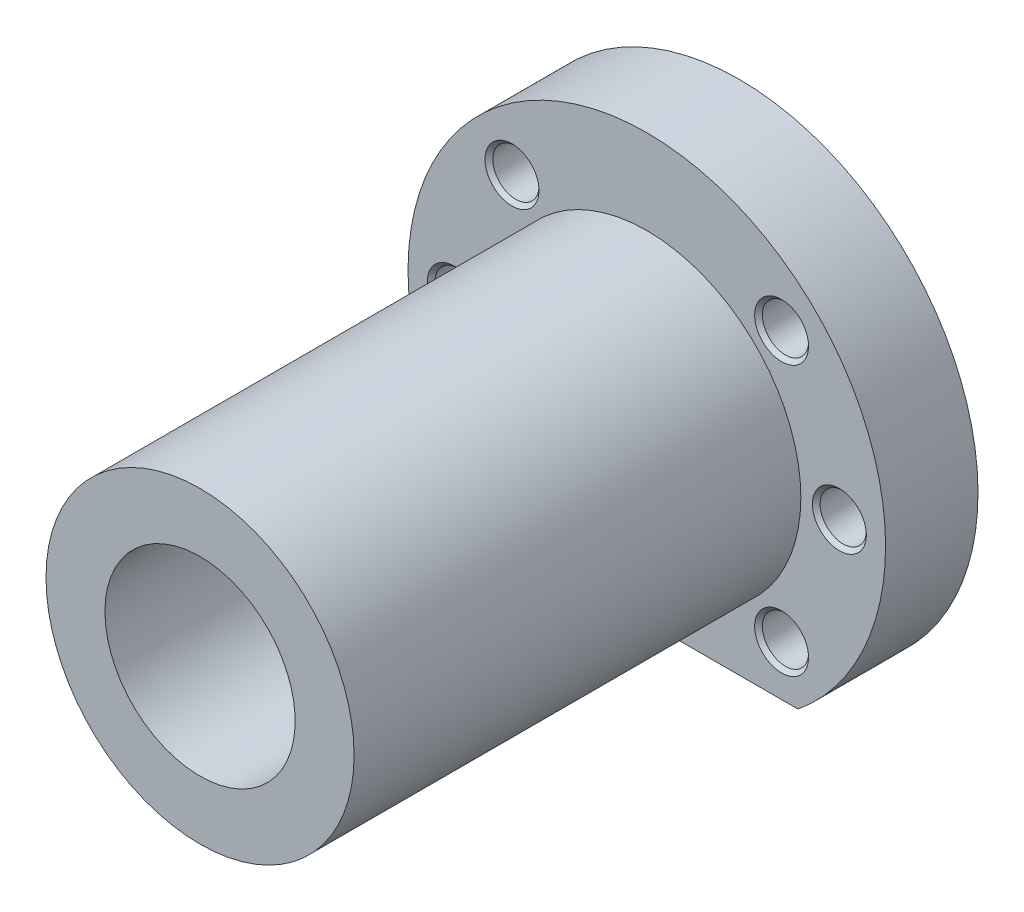
ISO-10303-21;
HEADER;
FILE_DESCRIPTION(('STEP AP214'),'2;1');
FILE_NAME('part.step','',(''),(''),'','','');
FILE_SCHEMA(('AUTOMOTIVE_DESIGN { 1 0 10303 214 1 1 1 1 }'));
ENDSEC;
DATA;
#1=APPLICATION_CONTEXT('core data for automotive mechanical design processes');
#2=APPLICATION_PROTOCOL_DEFINITION('international standard','automotive_design',2000,#1);
#3=PRODUCT_CONTEXT('',#1,'mechanical');
#4=PRODUCT('Part','Part','',(#3));
#5=PRODUCT_RELATED_PRODUCT_CATEGORY('part','',(#4));
#6=PRODUCT_DEFINITION_FORMATION('','',#4);
#7=PRODUCT_DEFINITION_CONTEXT('part definition',#1,'design');
#8=PRODUCT_DEFINITION('design','',#6,#7);
#9=PRODUCT_DEFINITION_SHAPE('','',#8);
#10=(LENGTH_UNIT() NAMED_UNIT(*) SI_UNIT(.MILLI.,.METRE.));
#11=(NAMED_UNIT(*) PLANE_ANGLE_UNIT() SI_UNIT($,.RADIAN.));
#12=(NAMED_UNIT(*) SI_UNIT($,.STERADIAN.) SOLID_ANGLE_UNIT());
#13=UNCERTAINTY_MEASURE_WITH_UNIT(LENGTH_MEASURE(1.E-05),#10,'distance_accuracy_value','');
#14=(GEOMETRIC_REPRESENTATION_CONTEXT(3) GLOBAL_UNCERTAINTY_ASSIGNED_CONTEXT((#13)) GLOBAL_UNIT_ASSIGNED_CONTEXT((#10,
#11,#12)) REPRESENTATION_CONTEXT('',''));
#15=CARTESIAN_POINT('',(0.,0.,0.));
#16=DIRECTION('',(0.,0.,1.));
#17=DIRECTION('',(1.,0.,0.));
#18=AXIS2_PLACEMENT_3D('',#15,#16,#17);
#19=CARTESIAN_POINT('',(0.,0.,58.));
#20=DIRECTION('',(0.,0.,-1.));
#21=DIRECTION('',(-1.,0.,0.));
#22=AXIS2_PLACEMENT_3D('',#19,#20,#21);
#23=CYLINDRICAL_SURFACE('',#22,20.);
#24=CARTESIAN_POINT('',(0.,0.,58.));
#25=DIRECTION('',(0.,0.,1.));
#26=DIRECTION('',(1.,0.,0.));
#27=AXIS2_PLACEMENT_3D('',#24,#25,#26);
#28=CIRCLE('',#27,20.);
#29=CARTESIAN_POINT('',(20.,0.,58.));
#30=VERTEX_POINT('',#29);
#31=EDGE_CURVE('E77',#30,#30,#28,.T.);
#32=ORIENTED_EDGE('',*,*,#31,.F.);
#33=EDGE_LOOP('',(#32));
#34=FACE_BOUND('',#33,.T.);
#35=CARTESIAN_POINT('',(0.,0.,0.));
#36=DIRECTION('',(0.,0.,1.));
#37=DIRECTION('',(1.,0.,0.));
#38=AXIS2_PLACEMENT_3D('',#35,#36,#37);
#39=CIRCLE('',#38,20.);
#40=CARTESIAN_POINT('',(20.,0.,0.));
#41=VERTEX_POINT('',#40);
#42=EDGE_CURVE('E73',#41,#41,#39,.T.);
#43=ORIENTED_EDGE('',*,*,#42,.T.);
#44=EDGE_LOOP('',(#43));
#45=FACE_BOUND('',#44,.T.);
#46=ADVANCED_FACE('F33',(#34,#45),#23,.T.);
#47=CARTESIAN_POINT('',(0.,0.,58.));
#48=DIRECTION('',(0.,0.,1.));
#49=DIRECTION('',(1.,0.,0.));
#50=AXIS2_PLACEMENT_3D('',#47,#48,#49);
#51=PLANE('',#50);
#52=CARTESIAN_POINT('',(0.,0.,58.));
#53=DIRECTION('',(0.,0.,-1.));
#54=DIRECTION('',(-1.,0.,0.));
#55=AXIS2_PLACEMENT_3D('',#52,#53,#54);
#56=CIRCLE('',#55,12.35);
#57=CARTESIAN_POINT('',(-12.35,0.,58.));
#58=VERTEX_POINT('',#57);
#59=EDGE_CURVE('E70',#58,#58,#56,.T.);
#60=ORIENTED_EDGE('',*,*,#59,.T.);
#61=EDGE_LOOP('',(#60));
#62=FACE_BOUND('',#61,.T.);
#63=ORIENTED_EDGE('',*,*,#31,.T.);
#64=EDGE_LOOP('',(#63));
#65=FACE_BOUND('',#64,.T.);
#66=ADVANCED_FACE('F179',(#62,#65),#51,.T.);
#67=CARTESIAN_POINT('',(0.,0.,-12.));
#68=DIRECTION('',(0.,0.,1.));
#69=DIRECTION('',(1.,0.,0.));
#70=AXIS2_PLACEMENT_3D('',#67,#68,#69);
#71=CYLINDRICAL_SURFACE('',#70,31.);
#72=CARTESIAN_POINT('',(0.,0.,0.));
#73=DIRECTION('',(0.,0.,-1.));
#74=DIRECTION('',(-1.,0.,0.));
#75=AXIS2_PLACEMENT_3D('',#72,#73,#74);
#76=CIRCLE('',#75,31.);
#77=CARTESIAN_POINT('',(-19.6214168703486,-24.,0.));
#78=VERTEX_POINT('',#77);
#79=CARTESIAN_POINT('',(19.6214168703486,-24.,0.));
#80=VERTEX_POINT('',#79);
#81=EDGE_CURVE('E74',#78,#80,#76,.T.);
#82=ORIENTED_EDGE('',*,*,#81,.T.);
#83=DIRECTION('',(0.,0.,-1.));
#84=VECTOR('',#83,1.);
#85=CARTESIAN_POINT('',(19.6214168703486,-24.,0.));
#86=LINE('',#85,#84);
#87=CARTESIAN_POINT('',(19.6214168703486,-24.,-12.));
#88=VERTEX_POINT('',#87);
#89=EDGE_CURVE('E48',#80,#88,#86,.T.);
#90=ORIENTED_EDGE('',*,*,#89,.T.);
#91=CARTESIAN_POINT('',(0.,0.,-12.));
#92=DIRECTION('',(0.,0.,-1.));
#93=DIRECTION('',(-1.,0.,0.));
#94=AXIS2_PLACEMENT_3D('',#91,#92,#93);
#95=CIRCLE('',#94,31.);
#96=CARTESIAN_POINT('',(-19.6214168703486,-24.,-12.));
#97=VERTEX_POINT('',#96);
#98=EDGE_CURVE('E69',#97,#88,#95,.T.);
#99=ORIENTED_EDGE('',*,*,#98,.F.);
#100=DIRECTION('',(0.,0.,-1.));
#101=VECTOR('',#100,1.);
#102=CARTESIAN_POINT('',(-19.6214168703486,-24.,0.));
#103=LINE('',#102,#101);
#104=EDGE_CURVE('E57',#78,#97,#103,.T.);
#105=ORIENTED_EDGE('',*,*,#104,.F.);
#106=EDGE_LOOP('',(#82,#90,#99,#105));
#107=FACE_BOUND('',#106,.T.);
#108=ADVANCED_FACE('F72',(#107),#71,.T.);
#109=CARTESIAN_POINT('',(0.,0.,-12.));
#110=DIRECTION('',(0.,0.,-1.));
#111=DIRECTION('',(-1.,0.,0.));
#112=AXIS2_PLACEMENT_3D('',#109,#110,#111);
#113=PLANE('',#112);
#114=CARTESIAN_POINT('',(17.5,17.5,-12.));
#115=DIRECTION('',(0.,0.,-1.));
#116=DIRECTION('',(-1.,0.,0.));
#117=AXIS2_PLACEMENT_3D('',#114,#115,#116);
#118=CIRCLE('',#117,3.5);
#119=CARTESIAN_POINT('',(14.,17.5,-12.));
#120=VERTEX_POINT('',#119);
#121=EDGE_CURVE('E11',#120,#120,#118,.F.);
#122=ORIENTED_EDGE('',*,*,#121,.T.);
#123=EDGE_LOOP('',(#122));
#124=FACE_BOUND('',#123,.T.);
#125=CARTESIAN_POINT('',(25.,0.,-12.));
#126=DIRECTION('',(0.,0.,-1.));
#127=DIRECTION('',(-1.,0.,0.));
#128=AXIS2_PLACEMENT_3D('',#125,#126,#127);
#129=CIRCLE('',#128,3.5);
#130=CARTESIAN_POINT('',(21.5,0.,-12.));
#131=VERTEX_POINT('',#130);
#132=EDGE_CURVE('E41',#131,#131,#129,.F.);
#133=ORIENTED_EDGE('',*,*,#132,.T.);
#134=EDGE_LOOP('',(#133));
#135=FACE_BOUND('',#134,.T.);
#136=CARTESIAN_POINT('',(17.5,-17.5,-12.));
#137=DIRECTION('',(0.,0.,-1.));
#138=DIRECTION('',(-1.,0.,0.));
#139=AXIS2_PLACEMENT_3D('',#136,#137,#138);
#140=CIRCLE('',#139,3.5);
#141=CARTESIAN_POINT('',(14.,-17.5,-12.));
#142=VERTEX_POINT('',#141);
#143=EDGE_CURVE('E147',#142,#142,#140,.F.);
#144=ORIENTED_EDGE('',*,*,#143,.T.);
#145=EDGE_LOOP('',(#144));
#146=FACE_BOUND('',#145,.T.);
#147=CARTESIAN_POINT('',(-17.5,-17.5,-12.));
#148=DIRECTION('',(0.,0.,-1.));
#149=DIRECTION('',(-1.,0.,0.));
#150=AXIS2_PLACEMENT_3D('',#147,#148,#149);
#151=CIRCLE('',#150,3.5);
#152=CARTESIAN_POINT('',(-21.,-17.5,-12.));
#153=VERTEX_POINT('',#152);
#154=EDGE_CURVE('E144',#153,#153,#151,.F.);
#155=ORIENTED_EDGE('',*,*,#154,.T.);
#156=EDGE_LOOP('',(#155));
#157=FACE_BOUND('',#156,.T.);
#158=CARTESIAN_POINT('',(-25.,0.,-12.));
#159=DIRECTION('',(0.,0.,-1.));
#160=DIRECTION('',(-1.,0.,0.));
#161=AXIS2_PLACEMENT_3D('',#158,#159,#160);
#162=CIRCLE('',#161,3.5);
#163=CARTESIAN_POINT('',(-28.5,0.,-12.));
#164=VERTEX_POINT('',#163);
#165=EDGE_CURVE('E141',#164,#164,#162,.F.);
#166=ORIENTED_EDGE('',*,*,#165,.T.);
#167=EDGE_LOOP('',(#166));
#168=FACE_BOUND('',#167,.T.);
#169=CARTESIAN_POINT('',(-17.5,17.5,-12.));
#170=DIRECTION('',(0.,0.,-1.));
#171=DIRECTION('',(-1.,0.,0.));
#172=AXIS2_PLACEMENT_3D('',#169,#170,#171);
#173=CIRCLE('',#172,3.5);
#174=CARTESIAN_POINT('',(-21.,17.5,-12.));
#175=VERTEX_POINT('',#174);
#176=EDGE_CURVE('E138',#175,#175,#173,.F.);
#177=ORIENTED_EDGE('',*,*,#176,.T.);
#178=EDGE_LOOP('',(#177));
#179=FACE_BOUND('',#178,.T.);
#180=CARTESIAN_POINT('',(0.,0.,-12.));
#181=DIRECTION('',(0.,0.,-1.));
#182=DIRECTION('',(-1.,0.,0.));
#183=AXIS2_PLACEMENT_3D('',#180,#181,#182);
#184=CIRCLE('',#183,12.35);
#185=CARTESIAN_POINT('',(-12.35,0.,-12.));
#186=VERTEX_POINT('',#185);
#187=EDGE_CURVE('E419',#186,#186,#184,.T.);
#188=ORIENTED_EDGE('',*,*,#187,.F.);
#189=EDGE_LOOP('',(#188));
#190=FACE_BOUND('',#189,.T.);
#191=DIRECTION('',(1.,0.,0.));
#192=VECTOR('',#191,1.);
#193=CARTESIAN_POINT('',(19.6214168703486,-24.,-12.));
#194=LINE('',#193,#192);
#195=EDGE_CURVE('E60',#97,#88,#194,.T.);
#196=ORIENTED_EDGE('',*,*,#195,.F.);
#197=ORIENTED_EDGE('',*,*,#98,.T.);
#198=EDGE_LOOP('',(#196,#197));
#199=FACE_BOUND('',#198,.T.);
#200=ADVANCED_FACE('F68',(#124,#135,#146,#157,#168,#179,#190,#199),#113,.T.);
#201=CARTESIAN_POINT('',(0.,0.,0.));
#202=DIRECTION('',(0.,0.,-1.));
#203=DIRECTION('',(-1.,0.,0.));
#204=AXIS2_PLACEMENT_3D('',#201,#202,#203);
#205=PLANE('',#204);
#206=CARTESIAN_POINT('',(-25.,0.,0.));
#207=DIRECTION('',(0.,0.,-1.));
#208=DIRECTION('',(-1.,0.,0.));
#209=AXIS2_PLACEMENT_3D('',#206,#207,#208);
#210=CIRCLE('',#209,3.49999999999999);
#211=CARTESIAN_POINT('',(-28.5,0.,0.));
#212=VERTEX_POINT('',#211);
#213=EDGE_CURVE('E99',#212,#212,#210,.T.);
#214=ORIENTED_EDGE('',*,*,#213,.T.);
#215=EDGE_LOOP('',(#214));
#216=FACE_BOUND('',#215,.T.);
#217=CARTESIAN_POINT('',(-17.5,-17.5,0.));
#218=DIRECTION('',(0.,0.,-1.));
#219=DIRECTION('',(-1.,0.,0.));
#220=AXIS2_PLACEMENT_3D('',#217,#218,#219);
#221=CIRCLE('',#220,3.49999999999999);
#222=CARTESIAN_POINT('',(-21.,-17.5,0.));
#223=VERTEX_POINT('',#222);
#224=EDGE_CURVE('E96',#223,#223,#221,.T.);
#225=ORIENTED_EDGE('',*,*,#224,.T.);
#226=EDGE_LOOP('',(#225));
#227=FACE_BOUND('',#226,.T.);
#228=CARTESIAN_POINT('',(17.5,-17.5,0.));
#229=DIRECTION('',(0.,0.,-1.));
#230=DIRECTION('',(-1.,0.,0.));
#231=AXIS2_PLACEMENT_3D('',#228,#229,#230);
#232=CIRCLE('',#231,3.49999999999999);
#233=CARTESIAN_POINT('',(14.,-17.5,0.));
#234=VERTEX_POINT('',#233);
#235=EDGE_CURVE('E93',#234,#234,#232,.T.);
#236=ORIENTED_EDGE('',*,*,#235,.T.);
#237=EDGE_LOOP('',(#236));
#238=FACE_BOUND('',#237,.T.);
#239=CARTESIAN_POINT('',(25.,0.,0.));
#240=DIRECTION('',(0.,0.,-1.));
#241=DIRECTION('',(-1.,0.,0.));
#242=AXIS2_PLACEMENT_3D('',#239,#240,#241);
#243=CIRCLE('',#242,3.49999999999999);
#244=CARTESIAN_POINT('',(21.5,0.,0.));
#245=VERTEX_POINT('',#244);
#246=EDGE_CURVE('E90',#245,#245,#243,.T.);
#247=ORIENTED_EDGE('',*,*,#246,.T.);
#248=EDGE_LOOP('',(#247));
#249=FACE_BOUND('',#248,.T.);
#250=CARTESIAN_POINT('',(17.5,17.5,0.));
#251=DIRECTION('',(0.,0.,-1.));
#252=DIRECTION('',(-1.,0.,0.));
#253=AXIS2_PLACEMENT_3D('',#250,#251,#252);
#254=CIRCLE('',#253,3.49999999999999);
#255=CARTESIAN_POINT('',(14.,17.5,0.));
#256=VERTEX_POINT('',#255);
#257=EDGE_CURVE('E87',#256,#256,#254,.T.);
#258=ORIENTED_EDGE('',*,*,#257,.T.);
#259=EDGE_LOOP('',(#258));
#260=FACE_BOUND('',#259,.T.);
#261=CARTESIAN_POINT('',(-17.5,17.5,0.));
#262=DIRECTION('',(0.,0.,-1.));
#263=DIRECTION('',(-1.,0.,0.));
#264=AXIS2_PLACEMENT_3D('',#261,#262,#263);
#265=CIRCLE('',#264,3.49999999999999);
#266=CARTESIAN_POINT('',(-21.,17.5,0.));
#267=VERTEX_POINT('',#266);
#268=EDGE_CURVE('E83',#267,#267,#265,.T.);
#269=ORIENTED_EDGE('',*,*,#268,.T.);
#270=EDGE_LOOP('',(#269));
#271=FACE_BOUND('',#270,.T.);
#272=ORIENTED_EDGE('',*,*,#42,.F.);
#273=EDGE_LOOP('',(#272));
#274=FACE_BOUND('',#273,.T.);
#275=ORIENTED_EDGE('',*,*,#81,.F.);
#276=DIRECTION('',(1.,0.,0.));
#277=VECTOR('',#276,1.);
#278=CARTESIAN_POINT('',(19.6214168703486,-24.,0.));
#279=LINE('',#278,#277);
#280=EDGE_CURVE('E53',#78,#80,#279,.T.);
#281=ORIENTED_EDGE('',*,*,#280,.T.);
#282=EDGE_LOOP('',(#275,#281));
#283=FACE_BOUND('',#282,.T.);
#284=ADVANCED_FACE('F254',(#216,#227,#238,#249,#260,#271,#274,#283),#205,.F.);
#285=CARTESIAN_POINT('',(19.6214168703486,-24.,0.));
#286=DIRECTION('',(0.,1.,0.));
#287=DIRECTION('',(0.,0.,1.));
#288=AXIS2_PLACEMENT_3D('',#285,#286,#287);
#289=PLANE('',#288);
#290=ORIENTED_EDGE('',*,*,#195,.T.);
#291=ORIENTED_EDGE('',*,*,#89,.F.);
#292=ORIENTED_EDGE('',*,*,#280,.F.);
#293=ORIENTED_EDGE('',*,*,#104,.T.);
#294=EDGE_LOOP('',(#290,#291,#292,#293));
#295=FACE_BOUND('',#294,.T.);
#296=ADVANCED_FACE('F59',(#295),#289,.F.);
#297=CARTESIAN_POINT('',(0.,0.,58.));
#298=DIRECTION('',(0.,0.,-1.));
#299=DIRECTION('',(-1.,0.,0.));
#300=AXIS2_PLACEMENT_3D('',#297,#298,#299);
#301=CYLINDRICAL_SURFACE('',#300,12.35);
#302=ORIENTED_EDGE('',*,*,#59,.F.);
#303=EDGE_LOOP('',(#302));
#304=FACE_BOUND('',#303,.T.);
#305=ORIENTED_EDGE('',*,*,#187,.T.);
#306=EDGE_LOOP('',(#305));
#307=FACE_BOUND('',#306,.T.);
#308=ADVANCED_FACE('F247',(#304,#307),#301,.F.);
#309=CARTESIAN_POINT('',(17.5,17.5,0.));
#310=DIRECTION('',(0.,0.,-1.));
#311=DIRECTION('',(-1.,0.,0.));
#312=AXIS2_PLACEMENT_3D('',#309,#310,#311);
#313=CYLINDRICAL_SURFACE('',#312,3.);
#314=CARTESIAN_POINT('',(17.5,17.5,-0.499999999999997));
#315=DIRECTION('',(0.,0.,-1.));
#316=DIRECTION('',(-1.,0.,0.));
#317=AXIS2_PLACEMENT_3D('',#314,#315,#316);
#318=CIRCLE('',#317,3.);
#319=CARTESIAN_POINT('',(14.5,17.5,-0.499999999999997));
#320=VERTEX_POINT('',#319);
#321=EDGE_CURVE('E129',#320,#320,#318,.F.);
#322=ORIENTED_EDGE('',*,*,#321,.T.);
#323=EDGE_LOOP('',(#322));
#324=FACE_BOUND('',#323,.T.);
#325=CARTESIAN_POINT('',(17.5,17.5,-11.5));
#326=DIRECTION('',(0.,0.,-1.));
#327=DIRECTION('',(-1.,0.,0.));
#328=AXIS2_PLACEMENT_3D('',#325,#326,#327);
#329=CIRCLE('',#328,3.);
#330=CARTESIAN_POINT('',(14.5,17.5,-11.5));
#331=VERTEX_POINT('',#330);
#332=EDGE_CURVE('E126',#331,#331,#329,.T.);
#333=ORIENTED_EDGE('',*,*,#332,.T.);
#334=EDGE_LOOP('',(#333));
#335=FACE_BOUND('',#334,.T.);
#336=ADVANCED_FACE('F175',(#324,#335),#313,.F.);
#337=CARTESIAN_POINT('',(17.5,-17.5,0.));
#338=DIRECTION('',(0.,0.,-1.));
#339=DIRECTION('',(-1.,0.,0.));
#340=AXIS2_PLACEMENT_3D('',#337,#338,#339);
#341=CYLINDRICAL_SURFACE('',#340,3.);
#342=CARTESIAN_POINT('',(17.5,-17.5,-0.499999999999997));
#343=DIRECTION('',(0.,0.,-1.));
#344=DIRECTION('',(-1.,0.,0.));
#345=AXIS2_PLACEMENT_3D('',#342,#343,#344);
#346=CIRCLE('',#345,3.);
#347=CARTESIAN_POINT('',(14.5,-17.5,-0.499999999999997));
#348=VERTEX_POINT('',#347);
#349=EDGE_CURVE('E117',#348,#348,#346,.F.);
#350=ORIENTED_EDGE('',*,*,#349,.T.);
#351=EDGE_LOOP('',(#350));
#352=FACE_BOUND('',#351,.T.);
#353=CARTESIAN_POINT('',(17.5,-17.5,-11.5));
#354=DIRECTION('',(0.,0.,-1.));
#355=DIRECTION('',(-1.,0.,0.));
#356=AXIS2_PLACEMENT_3D('',#353,#354,#355);
#357=CIRCLE('',#356,3.);
#358=CARTESIAN_POINT('',(14.5,-17.5,-11.5));
#359=VERTEX_POINT('',#358);
#360=EDGE_CURVE('E114',#359,#359,#357,.T.);
#361=ORIENTED_EDGE('',*,*,#360,.T.);
#362=EDGE_LOOP('',(#361));
#363=FACE_BOUND('',#362,.T.);
#364=ADVANCED_FACE('F165',(#352,#363),#341,.F.);
#365=CARTESIAN_POINT('',(25.,0.,0.));
#366=DIRECTION('',(0.,0.,-1.));
#367=DIRECTION('',(-1.,0.,0.));
#368=AXIS2_PLACEMENT_3D('',#365,#366,#367);
#369=CYLINDRICAL_SURFACE('',#368,3.);
#370=CARTESIAN_POINT('',(25.,0.,-0.499999999999998));
#371=DIRECTION('',(0.,0.,-1.));
#372=DIRECTION('',(-1.,0.,0.));
#373=AXIS2_PLACEMENT_3D('',#370,#371,#372);
#374=CIRCLE('',#373,3.);
#375=CARTESIAN_POINT('',(22.,0.,-0.499999999999998));
#376=VERTEX_POINT('',#375);
#377=EDGE_CURVE('E123',#376,#376,#374,.F.);
#378=ORIENTED_EDGE('',*,*,#377,.T.);
#379=EDGE_LOOP('',(#378));
#380=FACE_BOUND('',#379,.T.);
#381=CARTESIAN_POINT('',(25.,0.,-11.5));
#382=DIRECTION('',(0.,0.,-1.));
#383=DIRECTION('',(-1.,0.,0.));
#384=AXIS2_PLACEMENT_3D('',#381,#382,#383);
#385=CIRCLE('',#384,3.);
#386=CARTESIAN_POINT('',(22.,0.,-11.5));
#387=VERTEX_POINT('',#386);
#388=EDGE_CURVE('E120',#387,#387,#385,.T.);
#389=ORIENTED_EDGE('',*,*,#388,.T.);
#390=EDGE_LOOP('',(#389));
#391=FACE_BOUND('',#390,.T.);
#392=ADVANCED_FACE('F162',(#380,#391),#369,.F.);
#393=CARTESIAN_POINT('',(-17.5,-17.5,0.));
#394=DIRECTION('',(0.,0.,-1.));
#395=DIRECTION('',(-1.,0.,0.));
#396=AXIS2_PLACEMENT_3D('',#393,#394,#395);
#397=CYLINDRICAL_SURFACE('',#396,3.);
#398=CARTESIAN_POINT('',(-17.5,-17.5,-0.499999999999991));
#399=DIRECTION('',(0.,0.,-1.));
#400=DIRECTION('',(-1.,0.,0.));
#401=AXIS2_PLACEMENT_3D('',#398,#399,#400);
#402=CIRCLE('',#401,3.);
#403=CARTESIAN_POINT('',(-20.5,-17.5,-0.499999999999991));
#404=VERTEX_POINT('',#403);
#405=EDGE_CURVE('E111',#404,#404,#402,.F.);
#406=ORIENTED_EDGE('',*,*,#405,.T.);
#407=EDGE_LOOP('',(#406));
#408=FACE_BOUND('',#407,.T.);
#409=CARTESIAN_POINT('',(-17.5,-17.5,-11.5));
#410=DIRECTION('',(0.,0.,-1.));
#411=DIRECTION('',(-1.,0.,0.));
#412=AXIS2_PLACEMENT_3D('',#409,#410,#411);
#413=CIRCLE('',#412,3.);
#414=CARTESIAN_POINT('',(-20.5,-17.5,-11.5));
#415=VERTEX_POINT('',#414);
#416=EDGE_CURVE('E108',#415,#415,#413,.T.);
#417=ORIENTED_EDGE('',*,*,#416,.T.);
#418=EDGE_LOOP('',(#417));
#419=FACE_BOUND('',#418,.T.);
#420=ADVANCED_FACE('F164',(#408,#419),#397,.F.);
#421=CARTESIAN_POINT('',(-25.,0.,0.));
#422=DIRECTION('',(0.,0.,-1.));
#423=DIRECTION('',(-1.,0.,0.));
#424=AXIS2_PLACEMENT_3D('',#421,#422,#423);
#425=CYLINDRICAL_SURFACE('',#424,3.);
#426=CARTESIAN_POINT('',(-25.,0.,-0.499999999999998));
#427=DIRECTION('',(0.,0.,-1.));
#428=DIRECTION('',(-1.,0.,0.));
#429=AXIS2_PLACEMENT_3D('',#426,#427,#428);
#430=CIRCLE('',#429,3.);
#431=CARTESIAN_POINT('',(-28.,0.,-0.499999999999998));
#432=VERTEX_POINT('',#431);
#433=EDGE_CURVE('E105',#432,#432,#430,.F.);
#434=ORIENTED_EDGE('',*,*,#433,.T.);
#435=EDGE_LOOP('',(#434));
#436=FACE_BOUND('',#435,.T.);
#437=CARTESIAN_POINT('',(-25.,0.,-11.5));
#438=DIRECTION('',(0.,0.,-1.));
#439=DIRECTION('',(-1.,0.,0.));
#440=AXIS2_PLACEMENT_3D('',#437,#438,#439);
#441=CIRCLE('',#440,3.);
#442=CARTESIAN_POINT('',(-28.,0.,-11.5));
#443=VERTEX_POINT('',#442);
#444=EDGE_CURVE('E102',#443,#443,#441,.T.);
#445=ORIENTED_EDGE('',*,*,#444,.T.);
#446=EDGE_LOOP('',(#445));
#447=FACE_BOUND('',#446,.T.);
#448=ADVANCED_FACE('F172',(#436,#447),#425,.F.);
#449=CARTESIAN_POINT('',(-17.5,17.5,0.));
#450=DIRECTION('',(0.,0.,-1.));
#451=DIRECTION('',(-1.,0.,0.));
#452=AXIS2_PLACEMENT_3D('',#449,#450,#451);
#453=CYLINDRICAL_SURFACE('',#452,3.);
#454=CARTESIAN_POINT('',(-17.5,17.5,-0.499999999999991));
#455=DIRECTION('',(0.,0.,-1.));
#456=DIRECTION('',(-1.,0.,0.));
#457=AXIS2_PLACEMENT_3D('',#454,#455,#456);
#458=CIRCLE('',#457,3.);
#459=CARTESIAN_POINT('',(-20.5,17.5,-0.499999999999991));
#460=VERTEX_POINT('',#459);
#461=EDGE_CURVE('E135',#460,#460,#458,.F.);
#462=ORIENTED_EDGE('',*,*,#461,.T.);
#463=EDGE_LOOP('',(#462));
#464=FACE_BOUND('',#463,.T.);
#465=CARTESIAN_POINT('',(-17.5,17.5,-11.5));
#466=DIRECTION('',(0.,0.,-1.));
#467=DIRECTION('',(-1.,0.,0.));
#468=AXIS2_PLACEMENT_3D('',#465,#466,#467);
#469=CIRCLE('',#468,3.);
#470=CARTESIAN_POINT('',(-20.5,17.5,-11.5));
#471=VERTEX_POINT('',#470);
#472=EDGE_CURVE('E132',#471,#471,#469,.T.);
#473=ORIENTED_EDGE('',*,*,#472,.T.);
#474=EDGE_LOOP('',(#473));
#475=FACE_BOUND('',#474,.T.);
#476=ADVANCED_FACE('F195',(#464,#475),#453,.F.);
#477=CARTESIAN_POINT('',(-25.,0.,0.));
#478=DIRECTION('',(0.,0.,1.));
#479=DIRECTION('',(1.,0.,0.));
#480=AXIS2_PLACEMENT_3D('',#477,#478,#479);
#481=CONICAL_SURFACE('',#480,3.49999999999999,0.785398163397438);
#482=ORIENTED_EDGE('',*,*,#433,.F.);
#483=EDGE_LOOP('',(#482));
#484=FACE_BOUND('',#483,.T.);
#485=ORIENTED_EDGE('',*,*,#213,.F.);
#486=EDGE_LOOP('',(#485));
#487=FACE_BOUND('',#486,.T.);
#488=ADVANCED_FACE('F191',(#484,#487),#481,.F.);
#489=CARTESIAN_POINT('',(-17.5,-17.5,0.));
#490=DIRECTION('',(0.,0.,1.));
#491=DIRECTION('',(1.,0.,0.));
#492=AXIS2_PLACEMENT_3D('',#489,#490,#491);
#493=CONICAL_SURFACE('',#492,3.49999999999999,0.785398163397444);
#494=ORIENTED_EDGE('',*,*,#405,.F.);
#495=EDGE_LOOP('',(#494));
#496=FACE_BOUND('',#495,.T.);
#497=ORIENTED_EDGE('',*,*,#224,.F.);
#498=EDGE_LOOP('',(#497));
#499=FACE_BOUND('',#498,.T.);
#500=ADVANCED_FACE('F194',(#496,#499),#493,.F.);
#501=CARTESIAN_POINT('',(17.5,-17.5,0.));
#502=DIRECTION('',(0.,0.,1.));
#503=DIRECTION('',(1.,0.,0.));
#504=AXIS2_PLACEMENT_3D('',#501,#502,#503);
#505=CONICAL_SURFACE('',#504,3.49999999999999,0.785398163397437);
#506=ORIENTED_EDGE('',*,*,#349,.F.);
#507=EDGE_LOOP('',(#506));
#508=FACE_BOUND('',#507,.T.);
#509=ORIENTED_EDGE('',*,*,#235,.F.);
#510=EDGE_LOOP('',(#509));
#511=FACE_BOUND('',#510,.T.);
#512=ADVANCED_FACE('F199',(#508,#511),#505,.F.);
#513=CARTESIAN_POINT('',(25.,0.,0.));
#514=DIRECTION('',(0.,0.,1.));
#515=DIRECTION('',(1.,0.,0.));
#516=AXIS2_PLACEMENT_3D('',#513,#514,#515);
#517=CONICAL_SURFACE('',#516,3.49999999999999,0.785398163397438);
#518=ORIENTED_EDGE('',*,*,#377,.F.);
#519=EDGE_LOOP('',(#518));
#520=FACE_BOUND('',#519,.T.);
#521=ORIENTED_EDGE('',*,*,#246,.F.);
#522=EDGE_LOOP('',(#521));
#523=FACE_BOUND('',#522,.T.);
#524=ADVANCED_FACE('F203',(#520,#523),#517,.F.);
#525=CARTESIAN_POINT('',(17.5,17.5,0.));
#526=DIRECTION('',(0.,0.,1.));
#527=DIRECTION('',(1.,0.,0.));
#528=AXIS2_PLACEMENT_3D('',#525,#526,#527);
#529=CONICAL_SURFACE('',#528,3.49999999999999,0.785398163397437);
#530=ORIENTED_EDGE('',*,*,#321,.F.);
#531=EDGE_LOOP('',(#530));
#532=FACE_BOUND('',#531,.T.);
#533=ORIENTED_EDGE('',*,*,#257,.F.);
#534=EDGE_LOOP('',(#533));
#535=FACE_BOUND('',#534,.T.);
#536=ADVANCED_FACE('F207',(#532,#535),#529,.F.);
#537=CARTESIAN_POINT('',(-17.5,17.5,0.));
#538=DIRECTION('',(0.,0.,1.));
#539=DIRECTION('',(1.,0.,0.));
#540=AXIS2_PLACEMENT_3D('',#537,#538,#539);
#541=CONICAL_SURFACE('',#540,3.49999999999999,0.785398163397444);
#542=ORIENTED_EDGE('',*,*,#461,.F.);
#543=EDGE_LOOP('',(#542));
#544=FACE_BOUND('',#543,.T.);
#545=ORIENTED_EDGE('',*,*,#268,.F.);
#546=EDGE_LOOP('',(#545));
#547=FACE_BOUND('',#546,.T.);
#548=ADVANCED_FACE('F211',(#544,#547),#541,.F.);
#549=CARTESIAN_POINT('',(17.5,17.5,-11.5));
#550=DIRECTION('',(0.,0.,-1.));
#551=DIRECTION('',(-1.,0.,0.));
#552=AXIS2_PLACEMENT_3D('',#549,#550,#551);
#553=CONICAL_SURFACE('',#552,3.,0.785398163397451);
#554=ORIENTED_EDGE('',*,*,#121,.F.);
#555=EDGE_LOOP('',(#554));
#556=FACE_BOUND('',#555,.T.);
#557=ORIENTED_EDGE('',*,*,#332,.F.);
#558=EDGE_LOOP('',(#557));
#559=FACE_BOUND('',#558,.T.);
#560=ADVANCED_FACE('F158',(#556,#559),#553,.F.);
#561=CARTESIAN_POINT('',(25.,0.,-11.5));
#562=DIRECTION('',(0.,0.,-1.));
#563=DIRECTION('',(-1.,0.,0.));
#564=AXIS2_PLACEMENT_3D('',#561,#562,#563);
#565=CONICAL_SURFACE('',#564,3.,0.785398163397451);
#566=ORIENTED_EDGE('',*,*,#132,.F.);
#567=EDGE_LOOP('',(#566));
#568=FACE_BOUND('',#567,.T.);
#569=ORIENTED_EDGE('',*,*,#388,.F.);
#570=EDGE_LOOP('',(#569));
#571=FACE_BOUND('',#570,.T.);
#572=ADVANCED_FACE('F154',(#568,#571),#565,.F.);
#573=CARTESIAN_POINT('',(17.5,-17.5,-11.5));
#574=DIRECTION('',(0.,0.,-1.));
#575=DIRECTION('',(-1.,0.,0.));
#576=AXIS2_PLACEMENT_3D('',#573,#574,#575);
#577=CONICAL_SURFACE('',#576,3.,0.785398163397451);
#578=ORIENTED_EDGE('',*,*,#143,.F.);
#579=EDGE_LOOP('',(#578));
#580=FACE_BOUND('',#579,.T.);
#581=ORIENTED_EDGE('',*,*,#360,.F.);
#582=EDGE_LOOP('',(#581));
#583=FACE_BOUND('',#582,.T.);
#584=ADVANCED_FACE('F157',(#580,#583),#577,.F.);
#585=CARTESIAN_POINT('',(-17.5,-17.5,-11.5));
#586=DIRECTION('',(0.,0.,-1.));
#587=DIRECTION('',(-1.,0.,0.));
#588=AXIS2_PLACEMENT_3D('',#585,#586,#587);
#589=CONICAL_SURFACE('',#588,3.,0.785398163397451);
#590=ORIENTED_EDGE('',*,*,#154,.F.);
#591=EDGE_LOOP('',(#590));
#592=FACE_BOUND('',#591,.T.);
#593=ORIENTED_EDGE('',*,*,#416,.F.);
#594=EDGE_LOOP('',(#593));
#595=FACE_BOUND('',#594,.T.);
#596=ADVANCED_FACE('F221',(#592,#595),#589,.F.);
#597=CARTESIAN_POINT('',(-25.,0.,-11.5));
#598=DIRECTION('',(0.,0.,-1.));
#599=DIRECTION('',(-1.,0.,0.));
#600=AXIS2_PLACEMENT_3D('',#597,#598,#599);
#601=CONICAL_SURFACE('',#600,3.,0.785398163397451);
#602=ORIENTED_EDGE('',*,*,#165,.F.);
#603=EDGE_LOOP('',(#602));
#604=FACE_BOUND('',#603,.T.);
#605=ORIENTED_EDGE('',*,*,#444,.F.);
#606=EDGE_LOOP('',(#605));
#607=FACE_BOUND('',#606,.T.);
#608=ADVANCED_FACE('F224',(#604,#607),#601,.F.);
#609=CARTESIAN_POINT('',(-17.5,17.5,-11.5));
#610=DIRECTION('',(0.,0.,-1.));
#611=DIRECTION('',(-1.,0.,0.));
#612=AXIS2_PLACEMENT_3D('',#609,#610,#611);
#613=CONICAL_SURFACE('',#612,3.,0.785398163397451);
#614=ORIENTED_EDGE('',*,*,#176,.F.);
#615=EDGE_LOOP('',(#614));
#616=FACE_BOUND('',#615,.T.);
#617=ORIENTED_EDGE('',*,*,#472,.F.);
#618=EDGE_LOOP('',(#617));
#619=FACE_BOUND('',#618,.T.);
#620=ADVANCED_FACE('F35',(#616,#619),#613,.F.);
#621=CLOSED_SHELL('',(#46,#66,#108,#200,#284,#296,#308,#336,#364,#392,#420,#448,#476,#488,#500,
#512,#524,#536,#548,#560,#572,#584,#596,#608,#620));
#622=MANIFOLD_SOLID_BREP('B2',#621);
#623=ADVANCED_BREP_SHAPE_REPRESENTATION('',(#18,#622),#14);
#624=SHAPE_DEFINITION_REPRESENTATION(#9,#623);
ENDSEC;
END-ISO-10303-21;
